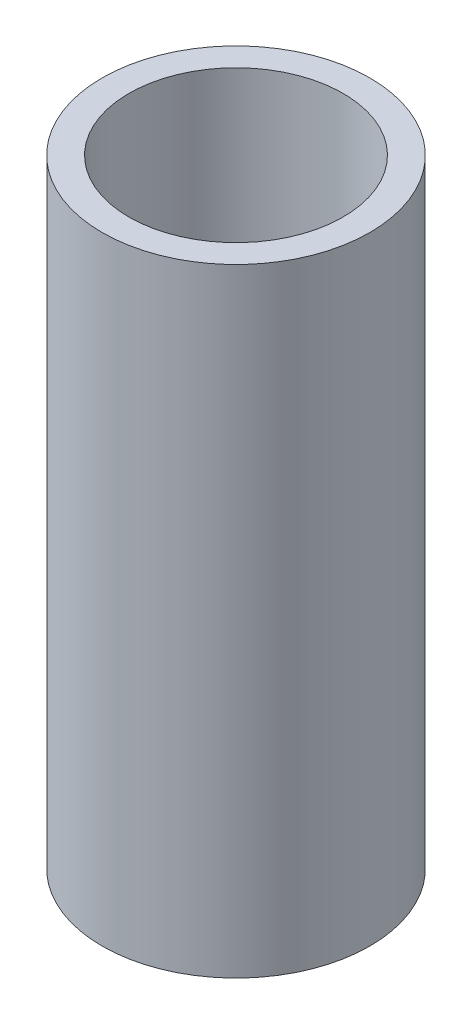
ISO-10303-21;
HEADER;
FILE_DESCRIPTION(('STEP AP214'),'2;1');
FILE_NAME('part.step','',(''),(''),'','','');
FILE_SCHEMA(('AUTOMOTIVE_DESIGN { 1 0 10303 214 1 1 1 1 }'));
ENDSEC;
DATA;
#1=APPLICATION_CONTEXT('core data for automotive mechanical design processes');
#2=APPLICATION_PROTOCOL_DEFINITION('international standard','automotive_design',2000,#1);
#3=PRODUCT_CONTEXT('',#1,'mechanical');
#4=PRODUCT('Part','Part','',(#3));
#5=PRODUCT_RELATED_PRODUCT_CATEGORY('part','',(#4));
#6=PRODUCT_DEFINITION_FORMATION('','',#4);
#7=PRODUCT_DEFINITION_CONTEXT('part definition',#1,'design');
#8=PRODUCT_DEFINITION('design','',#6,#7);
#9=PRODUCT_DEFINITION_SHAPE('','',#8);
#10=(LENGTH_UNIT() NAMED_UNIT(*) SI_UNIT(.MILLI.,.METRE.));
#11=(NAMED_UNIT(*) PLANE_ANGLE_UNIT() SI_UNIT($,.RADIAN.));
#12=(NAMED_UNIT(*) SI_UNIT($,.STERADIAN.) SOLID_ANGLE_UNIT());
#13=UNCERTAINTY_MEASURE_WITH_UNIT(LENGTH_MEASURE(1.E-05),#10,'distance_accuracy_value','');
#14=(GEOMETRIC_REPRESENTATION_CONTEXT(3) GLOBAL_UNCERTAINTY_ASSIGNED_CONTEXT((#13)) GLOBAL_UNIT_ASSIGNED_CONTEXT((#10,
#11,#12)) REPRESENTATION_CONTEXT('',''));
#15=CARTESIAN_POINT('',(0.,0.,0.));
#16=DIRECTION('',(0.,0.,1.));
#17=DIRECTION('',(1.,0.,0.));
#18=AXIS2_PLACEMENT_3D('',#15,#16,#17);
#19=CARTESIAN_POINT('',(0.,15.,0.));
#20=DIRECTION('',(0.,1.,0.));
#21=DIRECTION('',(0.,0.,1.));
#22=AXIS2_PLACEMENT_3D('',#19,#20,#21);
#23=PLANE('',#22);
#24=CARTESIAN_POINT('',(0.,15.,0.));
#25=DIRECTION('',(0.,1.,0.));
#26=DIRECTION('',(0.,0.,1.));
#27=AXIS2_PLACEMENT_3D('',#24,#25,#26);
#28=CIRCLE('',#27,3.25);
#29=CARTESIAN_POINT('',(0.,15.,3.25));
#30=VERTEX_POINT('',#29);
#31=EDGE_CURVE('E10',#30,#30,#28,.T.);
#32=ORIENTED_EDGE('',*,*,#31,.T.);
#33=EDGE_LOOP('',(#32));
#34=FACE_BOUND('',#33,.T.);
#35=CARTESIAN_POINT('',(0.,15.,0.));
#36=DIRECTION('',(0.,1.,0.));
#37=DIRECTION('',(0.,0.,1.));
#38=AXIS2_PLACEMENT_3D('',#35,#36,#37);
#39=CIRCLE('',#38,2.6);
#40=CARTESIAN_POINT('',(0.,15.,2.6));
#41=VERTEX_POINT('',#40);
#42=EDGE_CURVE('E42',#41,#41,#39,.T.);
#43=ORIENTED_EDGE('',*,*,#42,.F.);
#44=EDGE_LOOP('',(#43));
#45=FACE_BOUND('',#44,.T.);
#46=ADVANCED_FACE('F31',(#34,#45),#23,.T.);
#47=CARTESIAN_POINT('',(0.,0.,0.));
#48=DIRECTION('',(0.,1.,0.));
#49=DIRECTION('',(0.,0.,1.));
#50=AXIS2_PLACEMENT_3D('',#47,#48,#49);
#51=PLANE('',#50);
#52=CARTESIAN_POINT('',(0.,0.,0.));
#53=DIRECTION('',(0.,1.,0.));
#54=DIRECTION('',(0.,0.,1.));
#55=AXIS2_PLACEMENT_3D('',#52,#53,#54);
#56=CIRCLE('',#55,3.25);
#57=CARTESIAN_POINT('',(0.,0.,3.25));
#58=VERTEX_POINT('',#57);
#59=EDGE_CURVE('E35',#58,#58,#56,.T.);
#60=ORIENTED_EDGE('',*,*,#59,.F.);
#61=EDGE_LOOP('',(#60));
#62=FACE_BOUND('',#61,.T.);
#63=CARTESIAN_POINT('',(0.,0.,0.));
#64=DIRECTION('',(0.,1.,0.));
#65=DIRECTION('',(0.,0.,1.));
#66=AXIS2_PLACEMENT_3D('',#63,#64,#65);
#67=CIRCLE('',#66,2.6);
#68=CARTESIAN_POINT('',(0.,0.,2.6));
#69=VERTEX_POINT('',#68);
#70=EDGE_CURVE('E44',#69,#69,#67,.T.);
#71=ORIENTED_EDGE('',*,*,#70,.T.);
#72=EDGE_LOOP('',(#71));
#73=FACE_BOUND('',#72,.T.);
#74=ADVANCED_FACE('F54',(#62,#73),#51,.F.);
#75=CARTESIAN_POINT('',(0.,15.,0.));
#76=DIRECTION('',(0.,-1.,0.));
#77=DIRECTION('',(0.,0.,-1.));
#78=AXIS2_PLACEMENT_3D('',#75,#76,#77);
#79=CYLINDRICAL_SURFACE('',#78,3.25);
#80=ORIENTED_EDGE('',*,*,#31,.F.);
#81=EDGE_LOOP('',(#80));
#82=FACE_BOUND('',#81,.T.);
#83=ORIENTED_EDGE('',*,*,#59,.T.);
#84=EDGE_LOOP('',(#83));
#85=FACE_BOUND('',#84,.T.);
#86=ADVANCED_FACE('F33',(#82,#85),#79,.T.);
#87=CARTESIAN_POINT('',(0.,15.,0.));
#88=DIRECTION('',(0.,-1.,0.));
#89=DIRECTION('',(0.,0.,-1.));
#90=AXIS2_PLACEMENT_3D('',#87,#88,#89);
#91=CYLINDRICAL_SURFACE('',#90,2.6);
#92=ORIENTED_EDGE('',*,*,#42,.T.);
#93=EDGE_LOOP('',(#92));
#94=FACE_BOUND('',#93,.T.);
#95=ORIENTED_EDGE('',*,*,#70,.F.);
#96=EDGE_LOOP('',(#95));
#97=FACE_BOUND('',#96,.T.);
#98=ADVANCED_FACE('F50',(#94,#97),#91,.F.);
#99=CLOSED_SHELL('',(#46,#74,#86,#98));
#100=MANIFOLD_SOLID_BREP('B2',#99);
#101=ADVANCED_BREP_SHAPE_REPRESENTATION('',(#18,#100),#14);
#102=SHAPE_DEFINITION_REPRESENTATION(#9,#101);
ENDSEC;
END-ISO-10303-21;
